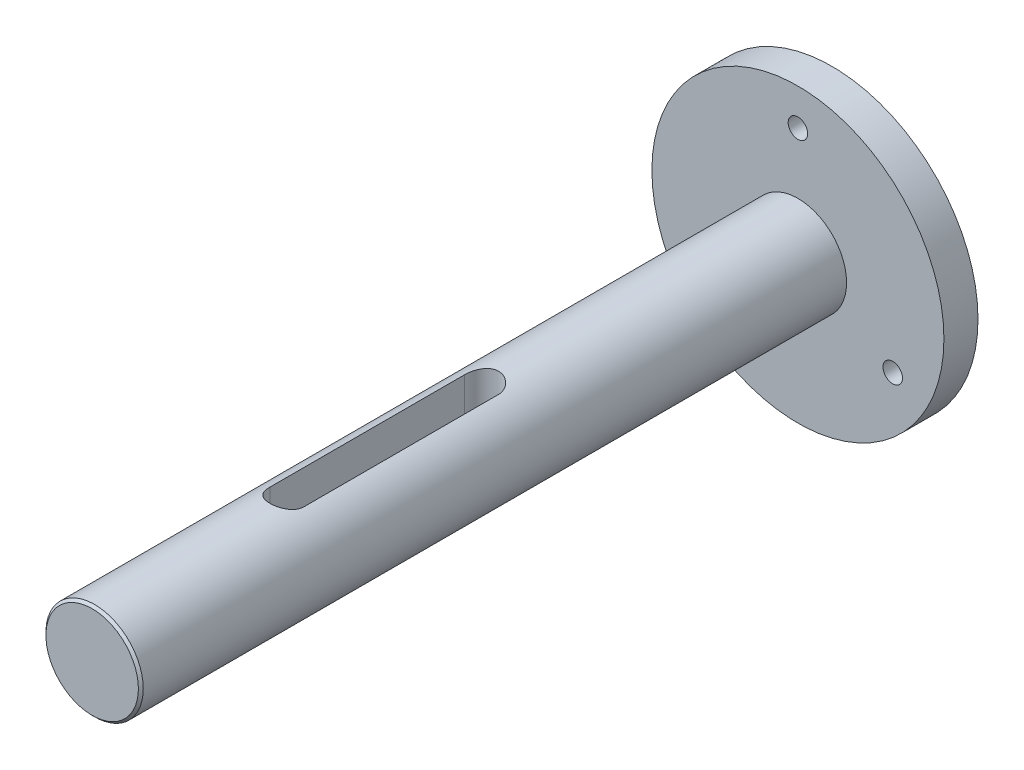
ISO-10303-21;
HEADER;
FILE_DESCRIPTION(('STEP AP214'),'2;1');
FILE_NAME('part.step','',(''),(''),'','','');
FILE_SCHEMA(('AUTOMOTIVE_DESIGN { 1 0 10303 214 1 1 1 1 }'));
ENDSEC;
DATA;
#1=APPLICATION_CONTEXT('core data for automotive mechanical design processes');
#2=APPLICATION_PROTOCOL_DEFINITION('international standard','automotive_design',2000,#1);
#3=PRODUCT_CONTEXT('',#1,'mechanical');
#4=PRODUCT('Part','Part','',(#3));
#5=PRODUCT_RELATED_PRODUCT_CATEGORY('part','',(#4));
#6=PRODUCT_DEFINITION_FORMATION('','',#4);
#7=PRODUCT_DEFINITION_CONTEXT('part definition',#1,'design');
#8=PRODUCT_DEFINITION('design','',#6,#7);
#9=PRODUCT_DEFINITION_SHAPE('','',#8);
#10=(LENGTH_UNIT() NAMED_UNIT(*) SI_UNIT(.MILLI.,.METRE.));
#11=(NAMED_UNIT(*) PLANE_ANGLE_UNIT() SI_UNIT($,.RADIAN.));
#12=(NAMED_UNIT(*) SI_UNIT($,.STERADIAN.) SOLID_ANGLE_UNIT());
#13=UNCERTAINTY_MEASURE_WITH_UNIT(LENGTH_MEASURE(1.E-05),#10,'distance_accuracy_value','');
#14=(GEOMETRIC_REPRESENTATION_CONTEXT(3) GLOBAL_UNCERTAINTY_ASSIGNED_CONTEXT((#13)) GLOBAL_UNIT_ASSIGNED_CONTEXT((#10,
#11,#12)) REPRESENTATION_CONTEXT('',''));
#15=CARTESIAN_POINT('',(0.,0.,0.));
#16=DIRECTION('',(0.,0.,1.));
#17=DIRECTION('',(1.,0.,0.));
#18=AXIS2_PLACEMENT_3D('',#15,#16,#17);
#19=CARTESIAN_POINT('',(0.,0.,7.));
#20=DIRECTION('',(0.,0.,1.));
#21=DIRECTION('',(1.,0.,0.));
#22=AXIS2_PLACEMENT_3D('',#19,#20,#21);
#23=PLANE('',#22);
#24=CARTESIAN_POINT('',(0.,0.,7.));
#25=DIRECTION('',(0.,0.,1.));
#26=DIRECTION('',(1.,0.,0.));
#27=AXIS2_PLACEMENT_3D('',#24,#25,#26);
#28=CIRCLE('',#27,10.);
#29=CARTESIAN_POINT('',(10.,0.,7.));
#30=VERTEX_POINT('',#29);
#31=EDGE_CURVE('E297',#30,#30,#28,.T.);
#32=ORIENTED_EDGE('',*,*,#31,.F.);
#33=EDGE_LOOP('',(#32));
#34=FACE_BOUND('',#33,.T.);
#35=CARTESIAN_POINT('',(19.4855715851499,-11.25,7.));
#36=DIRECTION('',(0.,0.,1.));
#37=DIRECTION('',(1.,0.,0.));
#38=AXIS2_PLACEMENT_3D('',#35,#36,#37);
#39=CIRCLE('',#38,2.);
#40=CARTESIAN_POINT('',(21.4855715851499,-11.25,7.));
#41=VERTEX_POINT('',#40);
#42=EDGE_CURVE('E307',#41,#41,#39,.T.);
#43=ORIENTED_EDGE('',*,*,#42,.F.);
#44=EDGE_LOOP('',(#43));
#45=FACE_BOUND('',#44,.T.);
#46=CARTESIAN_POINT('',(0.,0.,7.));
#47=DIRECTION('',(0.,0.,1.));
#48=DIRECTION('',(1.,0.,0.));
#49=AXIS2_PLACEMENT_3D('',#46,#47,#48);
#50=CIRCLE('',#49,30.);
#51=CARTESIAN_POINT('',(30.,0.,7.));
#52=VERTEX_POINT('',#51);
#53=EDGE_CURVE('E319',#52,#52,#50,.T.);
#54=ORIENTED_EDGE('',*,*,#53,.T.);
#55=EDGE_LOOP('',(#54));
#56=FACE_BOUND('',#55,.T.);
#57=CARTESIAN_POINT('',(0.,22.5,7.));
#58=DIRECTION('',(0.,0.,1.));
#59=DIRECTION('',(1.,0.,0.));
#60=AXIS2_PLACEMENT_3D('',#57,#58,#59);
#61=CIRCLE('',#60,2.);
#62=CARTESIAN_POINT('',(2.,22.5,7.));
#63=VERTEX_POINT('',#62);
#64=EDGE_CURVE('E313',#63,#63,#61,.T.);
#65=ORIENTED_EDGE('',*,*,#64,.F.);
#66=EDGE_LOOP('',(#65));
#67=FACE_BOUND('',#66,.T.);
#68=CARTESIAN_POINT('',(-19.4855715851499,-11.25,7.));
#69=DIRECTION('',(0.,0.,1.));
#70=DIRECTION('',(1.,0.,0.));
#71=AXIS2_PLACEMENT_3D('',#68,#69,#70);
#72=CIRCLE('',#71,2.);
#73=CARTESIAN_POINT('',(-17.4855715851499,-11.25,7.));
#74=VERTEX_POINT('',#73);
#75=EDGE_CURVE('E301',#74,#74,#72,.T.);
#76=ORIENTED_EDGE('',*,*,#75,.F.);
#77=EDGE_LOOP('',(#76));
#78=FACE_BOUND('',#77,.T.);
#79=ADVANCED_FACE('F33',(#34,#45,#56,#67,#78),#23,.T.);
#80=CARTESIAN_POINT('',(0.,0.,0.));
#81=DIRECTION('',(0.,0.,1.));
#82=DIRECTION('',(1.,0.,0.));
#83=AXIS2_PLACEMENT_3D('',#80,#81,#82);
#84=PLANE('',#83);
#85=CARTESIAN_POINT('',(0.,0.,0.));
#86=DIRECTION('',(0.,0.,1.));
#87=DIRECTION('',(1.,0.,0.));
#88=AXIS2_PLACEMENT_3D('',#85,#86,#87);
#89=CIRCLE('',#88,30.);
#90=CARTESIAN_POINT('',(30.,0.,0.));
#91=VERTEX_POINT('',#90);
#92=EDGE_CURVE('E316',#91,#91,#89,.T.);
#93=ORIENTED_EDGE('',*,*,#92,.F.);
#94=EDGE_LOOP('',(#93));
#95=FACE_BOUND('',#94,.T.);
#96=CARTESIAN_POINT('',(0.,22.5,0.));
#97=DIRECTION('',(0.,0.,1.));
#98=DIRECTION('',(1.,0.,0.));
#99=AXIS2_PLACEMENT_3D('',#96,#97,#98);
#100=CIRCLE('',#99,2.);
#101=CARTESIAN_POINT('',(2.,22.5,0.));
#102=VERTEX_POINT('',#101);
#103=EDGE_CURVE('E310',#102,#102,#100,.T.);
#104=ORIENTED_EDGE('',*,*,#103,.T.);
#105=EDGE_LOOP('',(#104));
#106=FACE_BOUND('',#105,.T.);
#107=CARTESIAN_POINT('',(19.4855715851499,-11.25,0.));
#108=DIRECTION('',(0.,0.,1.));
#109=DIRECTION('',(1.,0.,0.));
#110=AXIS2_PLACEMENT_3D('',#107,#108,#109);
#111=CIRCLE('',#110,2.);
#112=CARTESIAN_POINT('',(21.4855715851499,-11.25,0.));
#113=VERTEX_POINT('',#112);
#114=EDGE_CURVE('E304',#113,#113,#111,.T.);
#115=ORIENTED_EDGE('',*,*,#114,.T.);
#116=EDGE_LOOP('',(#115));
#117=FACE_BOUND('',#116,.T.);
#118=CARTESIAN_POINT('',(-19.4855715851499,-11.25,0.));
#119=DIRECTION('',(0.,0.,1.));
#120=DIRECTION('',(1.,0.,0.));
#121=AXIS2_PLACEMENT_3D('',#118,#119,#120);
#122=CIRCLE('',#121,2.);
#123=CARTESIAN_POINT('',(-17.4855715851499,-11.25,0.));
#124=VERTEX_POINT('',#123);
#125=EDGE_CURVE('E300',#124,#124,#122,.T.);
#126=ORIENTED_EDGE('',*,*,#125,.T.);
#127=EDGE_LOOP('',(#126));
#128=FACE_BOUND('',#127,.T.);
#129=ADVANCED_FACE('F194',(#95,#106,#117,#128),#84,.F.);
#130=CARTESIAN_POINT('',(0.,0.,7.));
#131=DIRECTION('',(0.,0.,-1.));
#132=DIRECTION('',(-1.,0.,0.));
#133=AXIS2_PLACEMENT_3D('',#130,#131,#132);
#134=CYLINDRICAL_SURFACE('',#133,30.);
#135=ORIENTED_EDGE('',*,*,#53,.F.);
#136=EDGE_LOOP('',(#135));
#137=FACE_BOUND('',#136,.T.);
#138=ORIENTED_EDGE('',*,*,#92,.T.);
#139=EDGE_LOOP('',(#138));
#140=FACE_BOUND('',#139,.T.);
#141=ADVANCED_FACE('F200',(#137,#140),#134,.T.);
#142=CARTESIAN_POINT('',(0.,22.5,7.));
#143=DIRECTION('',(0.,0.,-1.));
#144=DIRECTION('',(-1.,0.,0.));
#145=AXIS2_PLACEMENT_3D('',#142,#143,#144);
#146=CYLINDRICAL_SURFACE('',#145,2.);
#147=ORIENTED_EDGE('',*,*,#64,.T.);
#148=EDGE_LOOP('',(#147));
#149=FACE_BOUND('',#148,.T.);
#150=ORIENTED_EDGE('',*,*,#103,.F.);
#151=EDGE_LOOP('',(#150));
#152=FACE_BOUND('',#151,.T.);
#153=ADVANCED_FACE('F206',(#149,#152),#146,.F.);
#154=CARTESIAN_POINT('',(19.4855715851499,-11.25,7.));
#155=DIRECTION('',(0.,0.,-1.));
#156=DIRECTION('',(-1.,0.,0.));
#157=AXIS2_PLACEMENT_3D('',#154,#155,#156);
#158=CYLINDRICAL_SURFACE('',#157,2.);
#159=ORIENTED_EDGE('',*,*,#42,.T.);
#160=EDGE_LOOP('',(#159));
#161=FACE_BOUND('',#160,.T.);
#162=ORIENTED_EDGE('',*,*,#114,.F.);
#163=EDGE_LOOP('',(#162));
#164=FACE_BOUND('',#163,.T.);
#165=ADVANCED_FACE('F332',(#161,#164),#158,.F.);
#166=CARTESIAN_POINT('',(-19.4855715851499,-11.25,7.));
#167=DIRECTION('',(0.,0.,-1.));
#168=DIRECTION('',(-1.,0.,0.));
#169=AXIS2_PLACEMENT_3D('',#166,#167,#168);
#170=CYLINDRICAL_SURFACE('',#169,2.);
#171=ORIENTED_EDGE('',*,*,#75,.T.);
#172=EDGE_LOOP('',(#171));
#173=FACE_BOUND('',#172,.T.);
#174=ORIENTED_EDGE('',*,*,#125,.F.);
#175=EDGE_LOOP('',(#174));
#176=FACE_BOUND('',#175,.T.);
#177=ADVANCED_FACE('F190',(#173,#176),#170,.F.);
#178=CARTESIAN_POINT('',(0.,0.,152.));
#179=DIRECTION('',(0.,0.,-1.));
#180=DIRECTION('',(-1.,0.,0.));
#181=AXIS2_PLACEMENT_3D('',#178,#179,#180);
#182=CYLINDRICAL_SURFACE('',#181,10.);
#183=CARTESIAN_POINT('',(0.,0.,151.5));
#184=DIRECTION('',(0.,0.,1.));
#185=DIRECTION('',(1.,0.,0.));
#186=AXIS2_PLACEMENT_3D('',#183,#184,#185);
#187=CIRCLE('',#186,10.);
#188=CARTESIAN_POINT('',(10.,0.,151.5));
#189=VERTEX_POINT('',#188);
#190=EDGE_CURVE('E11',#189,#189,#187,.F.);
#191=ORIENTED_EDGE('',*,*,#190,.T.);
#192=EDGE_LOOP('',(#191));
#193=FACE_BOUND('',#192,.T.);
#194=DIRECTION('',(0.,0.,-1.));
#195=VECTOR('',#194,1.);
#196=CARTESIAN_POINT('',(2.00000000000001,-9.79795897113271,152.));
#197=LINE('',#196,#195);
#198=CARTESIAN_POINT('',(2.,-9.79795897113271,112.));
#199=VERTEX_POINT('',#198);
#200=CARTESIAN_POINT('',(2.,-9.79795897113271,72.));
#201=VERTEX_POINT('',#200);
#202=EDGE_CURVE('E120',#199,#201,#197,.T.);
#203=ORIENTED_EDGE('',*,*,#202,.T.);
#204=CARTESIAN_POINT('',(2.,-9.79795897113271,72.));
#205=CARTESIAN_POINT('',(2.00000029709046,-9.79795611157838,71.9443328627013));
#206=CARTESIAN_POINT('',(1.99767440405642,-9.79843398465431,71.8886929611951));
#207=CARTESIAN_POINT('',(1.98839986829158,-9.80032138150132,71.7778225643325));
#208=CARTESIAN_POINT('',(1.98145179742019,-9.80173079002197,71.7225920191848));
#209=CARTESIAN_POINT('',(1.95376239954903,-9.8073028328515,71.5582901196985));
#210=CARTESIAN_POINT('',(1.92617555297558,-9.81280956758554,71.4503371424655));
#211=CARTESIAN_POINT('',(1.85359362042638,-9.8267766040168,71.2407148065161));
#212=CARTESIAN_POINT('',(1.80859661275257,-9.83523723174864,71.1390461428865));
#213=CARTESIAN_POINT('',(1.7025082088197,-9.85415440257657,70.9446702322403));
#214=CARTESIAN_POINT('',(1.64141514447462,-9.86461115250626,70.8519639153823));
#215=CARTESIAN_POINT('',(1.50396101869286,-9.88650550448304,70.6768803266299));
#216=CARTESIAN_POINT('',(1.42741780364327,-9.89795377776164,70.5946474355412));
#217=CARTESIAN_POINT('',(1.2616211819837,-9.92044851228358,70.4440911214249));
#218=CARTESIAN_POINT('',(1.17236580968336,-9.93149491105252,70.3757698535391));
#219=CARTESIAN_POINT('',(0.98272010680059,-9.95205620855081,70.2544221981526));
#220=CARTESIAN_POINT('',(0.882239649549984,-9.96155694564014,70.2015340615754));
#221=CARTESIAN_POINT('',(0.673602404217795,-9.97783510908995,70.1134482309004));
#222=CARTESIAN_POINT('',(0.565446754297826,-9.9846129382442,70.0782479200882));
#223=CARTESIAN_POINT('',(0.346034817774201,-9.99460635553984,70.0269859030622));
#224=CARTESIAN_POINT('',(0.234838069151993,-9.99786765043076,70.0106784210322));
#225=CARTESIAN_POINT('',(0.0112397534982616,-10.0006184349224,69.9968980411232));
#226=CARTESIAN_POINT('',(-0.101161724783848,-10.000108200481,69.9994237652431));
#227=CARTESIAN_POINT('',(-0.322284405513384,-9.99540868887644,70.0230524007432));
#228=CARTESIAN_POINT('',(-0.431035226714458,-9.9912719366342,70.0438900998095));
#229=CARTESIAN_POINT('',(-0.643464013108166,-9.97984349003516,70.1031303539521));
#230=CARTESIAN_POINT('',(-0.747141812282546,-9.97255169250401,70.1415334834445));
#231=CARTESIAN_POINT('',(-0.94724054262592,-9.95554578241051,70.2350608069907));
#232=CARTESIAN_POINT('',(-1.04361145363295,-9.94581664782192,70.2902891738519));
#233=CARTESIAN_POINT('',(-1.22581287576612,-9.92500903258345,70.4158205405534));
#234=CARTESIAN_POINT('',(-1.31164251244036,-9.91393044014086,70.4861247896875));
#235=CARTESIAN_POINT('',(-1.47189241307715,-9.8914207473701,70.6412567232505));
#236=CARTESIAN_POINT('',(-1.54608938999208,-9.8799868648348,70.7263148041431));
#237=CARTESIAN_POINT('',(-1.67922179979889,-9.85823412232848,70.9078095169778));
#238=CARTESIAN_POINT('',(-1.73815300484306,-9.84791557170815,71.0042492903325));
#239=CARTESIAN_POINT('',(-1.83915990928954,-9.82955460084642,71.2061048098918));
#240=CARTESIAN_POINT('',(-1.881189753269,-9.82151838996691,71.3115440467932));
#241=CARTESIAN_POINT('',(-1.94681419465982,-9.80872322124987,71.5281172625114));
#242=CARTESIAN_POINT('',(-1.97043625496865,-9.80395938256574,71.6392424932963));
#243=CARTESIAN_POINT('',(-1.98966587624393,-9.80006354383926,71.7927136336929));
#244=CARTESIAN_POINT('',(-1.99354251131102,-9.79927519743986,71.8341082795649));
#245=CARTESIAN_POINT('',(-1.9987063293293,-9.79822334773544,71.9169957282748));
#246=CARTESIAN_POINT('',(-1.99999784580931,-9.79795896609649,71.9584882499116));
#247=CARTESIAN_POINT('',(-2.,-9.79795897113271,72.));
#248=B_SPLINE_CURVE_WITH_KNOTS('',3,(#204,#205,#206,#207,#208,#209,#210,#211,#212,#213,#214,
#215,#216,#217,#218,#219,#220,#221,#222,#223,#224,#225,#226,#227,#228,#229,#230,#231,#232,#233,
#234,#235,#236,#237,#238,#239,#240,#241,#242,#243,#244,#245,#246,#247),.UNSPECIFIED.,.F.,.F.,(4,
2,2,2,2,2,2,2,2,2,2,2,2,2,2,2,2,2,2,2,2,4),(0.,0.166897020715831,0.333773396643063,
0.666722601037227,0.999708566174145,1.33272905329863,1.66993288931438,2.00718892413591,
2.34737937755194,2.68751948879678,3.02318320738907,3.35882236614863,3.68967912555437,
4.02054670525121,4.35350597112352,4.68649283901807,5.02524540329292,5.3640916848566,
5.70385119298727,6.04310283225103,6.16778801087549,6.29226399953896),.UNSPECIFIED.);
#249=CARTESIAN_POINT('',(-2.,-9.79795897113272,72.));
#250=VERTEX_POINT('',#249);
#251=EDGE_CURVE('E112',#201,#250,#248,.T.);
#252=ORIENTED_EDGE('',*,*,#251,.T.);
#253=DIRECTION('',(0.,0.,-1.));
#254=VECTOR('',#253,1.);
#255=CARTESIAN_POINT('',(-1.99999999999999,-9.79795897113272,152.));
#256=LINE('',#255,#254);
#257=CARTESIAN_POINT('',(-1.99999999999999,-9.79795897113272,112.));
#258=VERTEX_POINT('',#257);
#259=EDGE_CURVE('E98',#250,#258,#256,.F.);
#260=ORIENTED_EDGE('',*,*,#259,.T.);
#261=CARTESIAN_POINT('',(-2.,-9.79795897113271,112.));
#262=CARTESIAN_POINT('',(-2.00000029709046,-9.79795611157838,112.055667137299));
#263=CARTESIAN_POINT('',(-1.99767440405641,-9.79843398465431,112.111307038805));
#264=CARTESIAN_POINT('',(-1.98839986829158,-9.80032138150132,112.222177435668));
#265=CARTESIAN_POINT('',(-1.98145179742018,-9.80173079002197,112.277407980815));
#266=CARTESIAN_POINT('',(-1.95376239954903,-9.8073028328515,112.441709880302));
#267=CARTESIAN_POINT('',(-1.92617555297558,-9.81280956758554,112.549662857534));
#268=CARTESIAN_POINT('',(-1.85359362042638,-9.8267766040168,112.759285193484));
#269=CARTESIAN_POINT('',(-1.80859661275256,-9.83523723174864,112.860953857114));
#270=CARTESIAN_POINT('',(-1.70250820881969,-9.85415440257657,113.05532976776));
#271=CARTESIAN_POINT('',(-1.64141514447461,-9.86461115250626,113.148036084618));
#272=CARTESIAN_POINT('',(-1.50396101869286,-9.88650550448304,113.32311967337));
#273=CARTESIAN_POINT('',(-1.42741780364327,-9.89795377776164,113.405352564459));
#274=CARTESIAN_POINT('',(-1.26162118198369,-9.92044851228359,113.555908878575));
#275=CARTESIAN_POINT('',(-1.17236580968335,-9.93149491105252,113.624230146461));
#276=CARTESIAN_POINT('',(-0.982720106800578,-9.95205620855081,113.745577801847));
#277=CARTESIAN_POINT('',(-0.882239649549973,-9.96155694564014,113.798465938425));
#278=CARTESIAN_POINT('',(-0.673602404217787,-9.97783510908995,113.8865517691));
#279=CARTESIAN_POINT('',(-0.565446754297818,-9.9846129382442,113.921752079912));
#280=CARTESIAN_POINT('',(-0.346034817774195,-9.99460635553984,113.973014096938));
#281=CARTESIAN_POINT('',(-0.234838069151987,-9.99786765043076,113.989321578968));
#282=CARTESIAN_POINT('',(-0.0112397534982561,-10.0006184349224,114.003101958877));
#283=CARTESIAN_POINT('',(0.101161724783853,-10.000108200481,114.000576234757));
#284=CARTESIAN_POINT('',(0.322284405513389,-9.99540868887644,113.976947599257));
#285=CARTESIAN_POINT('',(0.431035226714463,-9.9912719366342,113.95610990019));
#286=CARTESIAN_POINT('',(0.643464013108171,-9.97984349003515,113.896869646048));
#287=CARTESIAN_POINT('',(0.747141812282551,-9.97255169250401,113.858466516556));
#288=CARTESIAN_POINT('',(0.947240542625925,-9.95554578241051,113.764939193009));
#289=CARTESIAN_POINT('',(1.04361145363295,-9.94581664782192,113.709710826148));
#290=CARTESIAN_POINT('',(1.22581287576613,-9.92500903258345,113.584179459447));
#291=CARTESIAN_POINT('',(1.31164251244037,-9.91393044014085,113.513875210313));
#292=CARTESIAN_POINT('',(1.47189241307715,-9.8914207473701,113.35874327675));
#293=CARTESIAN_POINT('',(1.54608938999208,-9.8799868648348,113.273685195857));
#294=CARTESIAN_POINT('',(1.6792217997989,-9.85823412232848,113.092190483022));
#295=CARTESIAN_POINT('',(1.73815300484307,-9.84791557170815,112.995750709668));
#296=CARTESIAN_POINT('',(1.83915990928954,-9.82955460084642,112.793895190108));
#297=CARTESIAN_POINT('',(1.88118975326901,-9.8215183899669,112.688455953207));
#298=CARTESIAN_POINT('',(1.94681419465983,-9.80872322124987,112.471882737489));
#299=CARTESIAN_POINT('',(1.97043625496866,-9.80395938256574,112.360757506704));
#300=CARTESIAN_POINT('',(1.98966587624394,-9.80006354383926,112.207286366307));
#301=CARTESIAN_POINT('',(1.99354251131102,-9.79927519743986,112.165891720435));
#302=CARTESIAN_POINT('',(1.99870632932931,-9.79822334773544,112.083004271725));
#303=CARTESIAN_POINT('',(1.99999784580931,-9.79795896609649,112.041511750088));
#304=CARTESIAN_POINT('',(2.,-9.79795897113271,112.));
#305=B_SPLINE_CURVE_WITH_KNOTS('',3,(#261,#262,#263,#264,#265,#266,#267,#268,#269,#270,#271,
#272,#273,#274,#275,#276,#277,#278,#279,#280,#281,#282,#283,#284,#285,#286,#287,#288,#289,#290,
#291,#292,#293,#294,#295,#296,#297,#298,#299,#300,#301,#302,#303,#304),.UNSPECIFIED.,.F.,.F.,(4,
2,2,2,2,2,2,2,2,2,2,2,2,2,2,2,2,2,2,2,2,4),(0.,0.166897020715831,0.333773396643063,
0.666722601037227,0.999708566174161,1.33272905329863,1.66993288931438,2.00718892413592,
2.34737937755194,2.68751948879679,3.02318320738907,3.35882236614863,3.68967912555437,
4.02054670525121,4.35350597112352,4.68649283901807,5.02524540329292,5.3640916848566,
5.70385119298727,6.04310283225103,6.16778801087549,6.29226399953897),.UNSPECIFIED.);
#306=EDGE_CURVE('E106',#258,#199,#305,.T.);
#307=ORIENTED_EDGE('',*,*,#306,.T.);
#308=EDGE_LOOP('',(#203,#252,#260,#307));
#309=FACE_BOUND('',#308,.T.);
#310=DIRECTION('',(0.,0.,-1.));
#311=VECTOR('',#310,1.);
#312=CARTESIAN_POINT('',(-3.49999999999998,9.36749699759761,152.));
#313=LINE('',#312,#311);
#314=CARTESIAN_POINT('',(-3.49999999999999,9.36749699759761,112.));
#315=VERTEX_POINT('',#314);
#316=CARTESIAN_POINT('',(-3.49999999999998,9.36749699759761,72.));
#317=VERTEX_POINT('',#316);
#318=EDGE_CURVE('E169',#315,#317,#313,.T.);
#319=ORIENTED_EDGE('',*,*,#318,.T.);
#320=CARTESIAN_POINT('',(-3.49999999999999,9.3674969975976,72.));
#321=CARTESIAN_POINT('',(-3.50001290870869,9.36748079587137,71.9048181116927));
#322=CARTESIAN_POINT('',(-3.49611761580102,9.36894731061929,71.8096451979097));
#323=CARTESIAN_POINT('',(-3.48061126373695,9.37472506597358,71.620044223493));
#324=CARTESIAN_POINT('',(-3.46900248030438,9.37903546754067,71.5256159514784));
#325=CARTESIAN_POINT('',(-3.43821870694647,9.39036238019064,71.3384722809881));
#326=CARTESIAN_POINT('',(-3.41906789874553,9.39737024089891,71.2457523899186));
#327=CARTESIAN_POINT('',(-3.37340050494782,9.41385972932497,71.0623927150488));
#328=CARTESIAN_POINT('',(-3.34688361210789,9.42334146022815,70.9717530181853));
#329=CARTESIAN_POINT('',(-3.25665102509456,9.45506925925654,70.7040057734071));
#330=CARTESIAN_POINT('',(-3.18220361335761,9.48061744208823,70.5307711595539));
#331=CARTESIAN_POINT('',(-3.0070608913158,9.53761078303878,70.1992127837941));
#332=CARTESIAN_POINT('',(-2.90634738094283,9.56906002581126,70.0408994649774));
#333=CARTESIAN_POINT('',(-2.67688504812342,9.63582305978961,69.7368302162237));
#334=CARTESIAN_POINT('',(-2.54719588179148,9.67123974471417,69.5918050065814));
#335=CARTESIAN_POINT('',(-2.26546924856877,9.74108248534927,69.3250606895947));
#336=CARTESIAN_POINT('',(-2.11342768558354,9.77550835810713,69.2033458633302));
#337=CARTESIAN_POINT('',(-1.78584763006842,9.8407010706004,68.9832487000321));
#338=CARTESIAN_POINT('',(-1.60975388514351,9.87133218670086,68.8856489105183));
#339=CARTESIAN_POINT('',(-1.24239517910167,9.92425433590848,68.7217580525229));
#340=CARTESIAN_POINT('',(-1.05113527005908,9.94654813227259,68.6554566088448));
#341=CARTESIAN_POINT('',(-0.666590670274821,9.9795521899784,68.5585669112024));
#342=CARTESIAN_POINT('',(-0.47365987953881,9.99067089828651,68.5267158533532));
#343=CARTESIAN_POINT('',(-0.0848892814690368,10.0015281517553,68.4956038123617));
#344=CARTESIAN_POINT('',(0.110949741576456,10.0012697113129,68.4963341967058));
#345=CARTESIAN_POINT('',(0.490989738317242,9.98967161458308,68.5295896861643));
#346=CARTESIAN_POINT('',(0.675328059399544,9.97881100976233,68.5607402961428));
#347=CARTESIAN_POINT('',(1.03597082893503,9.94784089465941,68.651663950139));
#348=CARTESIAN_POINT('',(1.21227482460013,9.92773086381682,68.7114386051342));
#349=CARTESIAN_POINT('',(1.55471480559253,9.87993873138756,68.8586488544662));
#350=CARTESIAN_POINT('',(1.72067709782706,9.85215605871141,68.9464544388301));
#351=CARTESIAN_POINT('',(2.03590245131128,9.79187891683701,69.1469297704341));
#352=CARTESIAN_POINT('',(2.18516057457972,9.75938306084104,69.2596068409212));
#353=CARTESIAN_POINT('',(2.47086486770539,9.69110493662308,69.5133939345507));
#354=CARTESIAN_POINT('',(2.60625579568017,9.6552396043588,69.655669142123));
#355=CARTESIAN_POINT('',(2.85168490599478,9.58562532903772,69.9613086968956));
#356=CARTESIAN_POINT('',(2.96171430533782,9.55187712210248,70.1246803195652));
#357=CARTESIAN_POINT('',(3.10613834866616,9.50549949812691,70.3838437664487));
#358=CARTESIAN_POINT('',(3.15115700621636,9.49063185556225,70.4734697342177));
#359=CARTESIAN_POINT('',(3.23342988727473,9.46291794916449,70.6565040964853));
#360=CARTESIAN_POINT('',(3.27068737190209,9.45007083689549,70.7499108825613));
#361=CARTESIAN_POINT('',(3.33706008311089,9.42683763789705,70.9397485417923));
#362=CARTESIAN_POINT('',(3.36618438368869,9.41644881051096,71.0361759102372));
#363=CARTESIAN_POINT('',(3.41604788941062,9.39847413377985,71.231390715419));
#364=CARTESIAN_POINT('',(3.43679090503094,9.39088701080038,71.3301770579848));
#365=CARTESIAN_POINT('',(3.46877858288808,9.37911856107459,71.5238991681075));
#366=CARTESIAN_POINT('',(3.48048118596837,9.37477347975878,71.6187495549571));
#367=CARTESIAN_POINT('',(3.49609410027634,9.36895606934958,71.8090640867413));
#368=CARTESIAN_POINT('',(3.50001350432683,9.36748038808456,71.904527384614));
#369=CARTESIAN_POINT('',(3.50000000000001,9.36749699759759,72.));
#370=B_SPLINE_CURVE_WITH_KNOTS('',3,(#320,#321,#322,#323,#324,#325,#326,#327,#328,#329,#330,
#331,#332,#333,#334,#335,#336,#337,#338,#339,#340,#341,#342,#343,#344,#345,#346,#347,#348,#349,
#350,#351,#352,#353,#354,#355,#356,#357,#358,#359,#360,#361,#362,#363,#364,#365,#366,#367,#368,
#369),.UNSPECIFIED.,.F.,.F.,(4,2,2,2,2,2,2,2,2,2,2,2,2,2,2,2,2,2,2,2,2,2,2,2,4),(0.,
0.28543958649855,0.570794996655615,0.855242834861577,1.13970253931451,1.70772241452019,
2.27613692750188,2.86672388712457,3.45741920749039,4.0653135246422,4.67300618705685,
5.25757795850424,5.84199484749217,6.40117226237549,6.96038115177995,7.52729965431416,
8.09438530550649,8.69066694236568,9.28715476937553,9.59101301765141,9.89474333092357,
10.1981334133619,10.5013854065907,10.788030808142,11.0743411350263),.UNSPECIFIED.);
#371=CARTESIAN_POINT('',(3.50000000000001,9.36749699759759,72.));
#372=VERTEX_POINT('',#371);
#373=EDGE_CURVE('E173',#317,#372,#370,.T.);
#374=ORIENTED_EDGE('',*,*,#373,.T.);
#375=DIRECTION('',(0.,0.,-1.));
#376=VECTOR('',#375,1.);
#377=CARTESIAN_POINT('',(3.50000000000002,9.36749699759759,152.));
#378=LINE('',#377,#376);
#379=CARTESIAN_POINT('',(3.50000000000001,9.36749699759759,112.));
#380=VERTEX_POINT('',#379);
#381=EDGE_CURVE('E168',#372,#380,#378,.F.);
#382=ORIENTED_EDGE('',*,*,#381,.T.);
#383=CARTESIAN_POINT('',(3.50000000000001,9.36749699759759,112.));
#384=CARTESIAN_POINT('',(3.50001290870871,9.36748079587136,112.095181888307));
#385=CARTESIAN_POINT('',(3.49611761580104,9.36894731061929,112.19035480209));
#386=CARTESIAN_POINT('',(3.48061126373697,9.37472506597357,112.379955776507));
#387=CARTESIAN_POINT('',(3.4690024803044,9.37903546754067,112.474384048522));
#388=CARTESIAN_POINT('',(3.43821870694649,9.39036238019064,112.661527719012));
#389=CARTESIAN_POINT('',(3.41906789874555,9.3973702408989,112.754247610081));
#390=CARTESIAN_POINT('',(3.37340050494784,9.41385972932496,112.937607284951));
#391=CARTESIAN_POINT('',(3.34688361210791,9.42334146022814,113.028246981815));
#392=CARTESIAN_POINT('',(3.25665102509458,9.45506925925653,113.295994226593));
#393=CARTESIAN_POINT('',(3.18220361335763,9.48061744208822,113.469228840446));
#394=CARTESIAN_POINT('',(3.00706089131582,9.53761078303877,113.800787216206));
#395=CARTESIAN_POINT('',(2.90634738094285,9.56906002581126,113.959100535023));
#396=CARTESIAN_POINT('',(2.67688504812345,9.63582305978961,114.263169783776));
#397=CARTESIAN_POINT('',(2.5471958817915,9.67123974471416,114.408194993419));
#398=CARTESIAN_POINT('',(2.2654692485688,9.74108248534926,114.674939310405));
#399=CARTESIAN_POINT('',(2.11342768558357,9.77550835810712,114.79665413667));
#400=CARTESIAN_POINT('',(1.78584763006845,9.8407010706004,115.016751299968));
#401=CARTESIAN_POINT('',(1.60975388514353,9.87133218670085,115.114351089482));
#402=CARTESIAN_POINT('',(1.2423951791017,9.92425433590847,115.278241947477));
#403=CARTESIAN_POINT('',(1.05113527005911,9.94654813227259,115.344543391155));
#404=CARTESIAN_POINT('',(0.666590670274856,9.97955218997839,115.441433088798));
#405=CARTESIAN_POINT('',(0.473659879538841,9.99067089828651,115.473284146647));
#406=CARTESIAN_POINT('',(0.0848892814690629,10.0015281517553,115.504396187638));
#407=CARTESIAN_POINT('',(-0.110949741576432,10.0012697113129,115.503665803294));
#408=CARTESIAN_POINT('',(-0.49098973831722,9.98967161458308,115.470410313836));
#409=CARTESIAN_POINT('',(-0.675328059399521,9.97881100976233,115.439259703857));
#410=CARTESIAN_POINT('',(-1.03597082893501,9.94784089465942,115.348336049861));
#411=CARTESIAN_POINT('',(-1.21227482460011,9.92773086381682,115.288561394866));
#412=CARTESIAN_POINT('',(-1.55471480559251,9.87993873138757,115.141351145534));
#413=CARTESIAN_POINT('',(-1.72067709782703,9.85215605871141,115.05354556117));
#414=CARTESIAN_POINT('',(-2.03590245131126,9.79187891683701,114.853070229566));
#415=CARTESIAN_POINT('',(-2.18516057457969,9.75938306084105,114.740393159079));
#416=CARTESIAN_POINT('',(-2.47086486770537,9.69110493662308,114.486606065449));
#417=CARTESIAN_POINT('',(-2.60625579568015,9.65523960435881,114.344330857877));
#418=CARTESIAN_POINT('',(-2.85168490599476,9.58562532903773,114.038691303104));
#419=CARTESIAN_POINT('',(-2.9617143053378,9.55187712210249,113.875319680435));
#420=CARTESIAN_POINT('',(-3.10613834866614,9.50549949812691,113.616156233551));
#421=CARTESIAN_POINT('',(-3.15115700621633,9.49063185556226,113.526530265782));
#422=CARTESIAN_POINT('',(-3.23342988727471,9.4629179491645,113.343495903515));
#423=CARTESIAN_POINT('',(-3.27068737190206,9.4500708368955,113.250089117439));
#424=CARTESIAN_POINT('',(-3.33706008311087,9.42683763789706,113.060251458208));
#425=CARTESIAN_POINT('',(-3.36618438368866,9.41644881051097,112.963824089763));
#426=CARTESIAN_POINT('',(-3.4160478894106,9.39847413377986,112.768609284581));
#427=CARTESIAN_POINT('',(-3.43679090503091,9.39088701080038,112.669822942015));
#428=CARTESIAN_POINT('',(-3.46877858288805,9.3791185610746,112.476100831893));
#429=CARTESIAN_POINT('',(-3.48048118596835,9.37477347975879,112.381250445043));
#430=CARTESIAN_POINT('',(-3.49609410027631,9.3689560693496,112.190935913259));
#431=CARTESIAN_POINT('',(-3.5000135043268,9.36748038808457,112.095472615386));
#432=CARTESIAN_POINT('',(-3.49999999999999,9.3674969975976,112.));
#433=B_SPLINE_CURVE_WITH_KNOTS('',3,(#383,#384,#385,#386,#387,#388,#389,#390,#391,#392,#393,
#394,#395,#396,#397,#398,#399,#400,#401,#402,#403,#404,#405,#406,#407,#408,#409,#410,#411,#412,
#413,#414,#415,#416,#417,#418,#419,#420,#421,#422,#423,#424,#425,#426,#427,#428,#429,#430,#431,
#432),.UNSPECIFIED.,.F.,.F.,(4,2,2,2,2,2,2,2,2,2,2,2,2,2,2,2,2,2,2,2,2,2,2,2,4),(0.,
0.28543958649855,0.570794996655615,0.855242834861577,1.13970253931451,1.70772241452019,
2.27613692750188,2.86672388712457,3.45741920749039,4.0653135246422,4.67300618705684,
5.25757795850424,5.84199484749217,6.40117226237549,6.96038115177995,7.52729965431416,
8.09438530550649,8.69066694236568,9.28715476937553,9.59101301765141,9.89474333092357,
10.1981334133619,10.5013854065907,10.788030808142,11.0743411350263),.UNSPECIFIED.);
#434=EDGE_CURVE('E160',#380,#315,#433,.T.);
#435=ORIENTED_EDGE('',*,*,#434,.T.);
#436=EDGE_LOOP('',(#319,#374,#382,#435));
#437=FACE_BOUND('',#436,.T.);
#438=ORIENTED_EDGE('',*,*,#31,.T.);
#439=EDGE_LOOP('',(#438));
#440=FACE_BOUND('',#439,.T.);
#441=ADVANCED_FACE('F118',(#193,#309,#437,#440),#182,.T.);
#442=CARTESIAN_POINT('',(0.,0.,152.));
#443=DIRECTION('',(0.,0.,1.));
#444=DIRECTION('',(1.,0.,0.));
#445=AXIS2_PLACEMENT_3D('',#442,#443,#444);
#446=PLANE('',#445);
#447=CARTESIAN_POINT('',(0.,0.,152.));
#448=DIRECTION('',(0.,0.,1.));
#449=DIRECTION('',(1.,0.,0.));
#450=AXIS2_PLACEMENT_3D('',#447,#448,#449);
#451=CIRCLE('',#450,9.50000000000002);
#452=CARTESIAN_POINT('',(9.50000000000002,0.,152.));
#453=VERTEX_POINT('',#452);
#454=EDGE_CURVE('E41',#453,#453,#451,.T.);
#455=ORIENTED_EDGE('',*,*,#454,.T.);
#456=EDGE_LOOP('',(#455));
#457=FACE_BOUND('',#456,.T.);
#458=ADVANCED_FACE('F183',(#457),#446,.T.);
#459=CARTESIAN_POINT('',(0.,-1.5,72.));
#460=DIRECTION('',(0.,1.,0.));
#461=DIRECTION('',(0.,0.,1.));
#462=AXIS2_PLACEMENT_3D('',#459,#460,#461);
#463=CYLINDRICAL_SURFACE('',#462,3.5);
#464=DIRECTION('',(0.,1.,0.));
#465=VECTOR('',#464,1.);
#466=CARTESIAN_POINT('',(-3.49999999999999,-1.5,72.));
#467=LINE('',#466,#465);
#468=CARTESIAN_POINT('',(-3.49999999999999,0.,72.));
#469=VERTEX_POINT('',#468);
#470=EDGE_CURVE('E252',#469,#317,#467,.T.);
#471=ORIENTED_EDGE('',*,*,#470,.F.);
#472=CARTESIAN_POINT('',(0.,0.,72.));
#473=DIRECTION('',(0.,1.,0.));
#474=DIRECTION('',(0.,0.,1.));
#475=AXIS2_PLACEMENT_3D('',#472,#473,#474);
#476=CIRCLE('',#475,3.5);
#477=CARTESIAN_POINT('',(3.50000000000001,0.,72.));
#478=VERTEX_POINT('',#477);
#479=EDGE_CURVE('E233',#469,#478,#476,.F.);
#480=ORIENTED_EDGE('',*,*,#479,.T.);
#481=DIRECTION('',(0.,1.,0.));
#482=VECTOR('',#481,1.);
#483=CARTESIAN_POINT('',(3.50000000000001,-1.5,72.));
#484=LINE('',#483,#482);
#485=EDGE_CURVE('E135',#478,#372,#484,.T.);
#486=ORIENTED_EDGE('',*,*,#485,.T.);
#487=ORIENTED_EDGE('',*,*,#373,.F.);
#488=EDGE_LOOP('',(#471,#480,#486,#487));
#489=FACE_BOUND('',#488,.T.);
#490=ADVANCED_FACE('F151',(#489),#463,.F.);
#491=CARTESIAN_POINT('',(3.50000000000001,-1.5,72.));
#492=DIRECTION('',(1.,0.,0.));
#493=DIRECTION('',(0.,0.,-1.));
#494=AXIS2_PLACEMENT_3D('',#491,#492,#493);
#495=PLANE('',#494);
#496=ORIENTED_EDGE('',*,*,#485,.F.);
#497=DIRECTION('',(0.,0.,1.));
#498=VECTOR('',#497,1.);
#499=CARTESIAN_POINT('',(3.50000000000001,0.,72.));
#500=LINE('',#499,#498);
#501=CARTESIAN_POINT('',(3.50000000000001,0.,112.));
#502=VERTEX_POINT('',#501);
#503=EDGE_CURVE('E239',#478,#502,#500,.T.);
#504=ORIENTED_EDGE('',*,*,#503,.T.);
#505=DIRECTION('',(0.,1.,0.));
#506=VECTOR('',#505,1.);
#507=CARTESIAN_POINT('',(3.50000000000001,-1.5,112.));
#508=LINE('',#507,#506);
#509=EDGE_CURVE('E292',#502,#380,#508,.T.);
#510=ORIENTED_EDGE('',*,*,#509,.T.);
#511=ORIENTED_EDGE('',*,*,#381,.F.);
#512=EDGE_LOOP('',(#496,#504,#510,#511));
#513=FACE_BOUND('',#512,.T.);
#514=ADVANCED_FACE('F147',(#513),#495,.F.);
#515=CARTESIAN_POINT('',(0.,-1.5,112.));
#516=DIRECTION('',(0.,1.,0.));
#517=DIRECTION('',(0.,0.,1.));
#518=AXIS2_PLACEMENT_3D('',#515,#516,#517);
#519=CYLINDRICAL_SURFACE('',#518,3.5);
#520=ORIENTED_EDGE('',*,*,#509,.F.);
#521=CARTESIAN_POINT('',(0.,0.,112.));
#522=DIRECTION('',(0.,1.,0.));
#523=DIRECTION('',(0.,0.,1.));
#524=AXIS2_PLACEMENT_3D('',#521,#522,#523);
#525=CIRCLE('',#524,3.5);
#526=CARTESIAN_POINT('',(-3.49999999999999,0.,112.));
#527=VERTEX_POINT('',#526);
#528=EDGE_CURVE('E242',#502,#527,#525,.F.);
#529=ORIENTED_EDGE('',*,*,#528,.T.);
#530=DIRECTION('',(0.,1.,0.));
#531=VECTOR('',#530,1.);
#532=CARTESIAN_POINT('',(-3.49999999999999,-1.5,112.));
#533=LINE('',#532,#531);
#534=EDGE_CURVE('E290',#527,#315,#533,.T.);
#535=ORIENTED_EDGE('',*,*,#534,.T.);
#536=ORIENTED_EDGE('',*,*,#434,.F.);
#537=EDGE_LOOP('',(#520,#529,#535,#536));
#538=FACE_BOUND('',#537,.T.);
#539=ADVANCED_FACE('F150',(#538),#519,.F.);
#540=CARTESIAN_POINT('',(-3.49999999999999,-1.5,72.));
#541=DIRECTION('',(-1.,0.,0.));
#542=DIRECTION('',(0.,0.,1.));
#543=AXIS2_PLACEMENT_3D('',#540,#541,#542);
#544=PLANE('',#543);
#545=ORIENTED_EDGE('',*,*,#534,.F.);
#546=DIRECTION('',(0.,0.,-1.));
#547=VECTOR('',#546,1.);
#548=CARTESIAN_POINT('',(-3.49999999999999,0.,72.));
#549=LINE('',#548,#547);
#550=EDGE_CURVE('E56',#527,#469,#549,.T.);
#551=ORIENTED_EDGE('',*,*,#550,.T.);
#552=ORIENTED_EDGE('',*,*,#470,.T.);
#553=ORIENTED_EDGE('',*,*,#318,.F.);
#554=EDGE_LOOP('',(#545,#551,#552,#553));
#555=FACE_BOUND('',#554,.T.);
#556=ADVANCED_FACE('F156',(#555),#544,.F.);
#557=CARTESIAN_POINT('',(0.,-1.5,72.));
#558=DIRECTION('',(0.,1.,0.));
#559=DIRECTION('',(0.,0.,1.));
#560=AXIS2_PLACEMENT_3D('',#557,#558,#559);
#561=CONICAL_SURFACE('',#560,2.,0.785398163397449);
#562=DIRECTION('',(-0.707106781186548,-0.707106781186547,0.));
#563=VECTOR('',#562,1.);
#564=CARTESIAN_POINT('',(3.50000000000001,0.,72.));
#565=LINE('',#564,#563);
#566=CARTESIAN_POINT('',(2.,-1.50000000000001,72.));
#567=VERTEX_POINT('',#566);
#568=EDGE_CURVE('E231',#478,#567,#565,.T.);
#569=ORIENTED_EDGE('',*,*,#568,.F.);
#570=ORIENTED_EDGE('',*,*,#479,.F.);
#571=DIRECTION('',(-0.707106781186548,0.707106781186547,0.));
#572=VECTOR('',#571,1.);
#573=CARTESIAN_POINT('',(-1.99999999999999,-1.5,72.));
#574=LINE('',#573,#572);
#575=CARTESIAN_POINT('',(-2.,-1.49999999999999,72.));
#576=VERTEX_POINT('',#575);
#577=EDGE_CURVE('E236',#576,#469,#574,.T.);
#578=ORIENTED_EDGE('',*,*,#577,.F.);
#579=CARTESIAN_POINT('',(0.,-1.5,72.));
#580=DIRECTION('',(0.,1.,0.));
#581=DIRECTION('',(0.,0.,1.));
#582=AXIS2_PLACEMENT_3D('',#579,#580,#581);
#583=CIRCLE('',#582,2.);
#584=EDGE_CURVE('E115',#567,#576,#583,.T.);
#585=ORIENTED_EDGE('',*,*,#584,.F.);
#586=EDGE_LOOP('',(#569,#570,#578,#585));
#587=FACE_BOUND('',#586,.T.);
#588=ADVANCED_FACE('F221',(#587),#561,.F.);
#589=CARTESIAN_POINT('',(-1.99999999999999,-1.5,72.));
#590=DIRECTION('',(-0.707106781186547,-0.707106781186548,0.));
#591=DIRECTION('',(0.,0.,1.));
#592=AXIS2_PLACEMENT_3D('',#589,#590,#591);
#593=PLANE('',#592);
#594=ORIENTED_EDGE('',*,*,#577,.T.);
#595=ORIENTED_EDGE('',*,*,#550,.F.);
#596=DIRECTION('',(-0.707106781186548,0.707106781186547,0.));
#597=VECTOR('',#596,1.);
#598=CARTESIAN_POINT('',(-1.99999999999999,-1.5,112.));
#599=LINE('',#598,#597);
#600=CARTESIAN_POINT('',(-1.99999999999999,-1.5,112.));
#601=VERTEX_POINT('',#600);
#602=EDGE_CURVE('E124',#601,#527,#599,.T.);
#603=ORIENTED_EDGE('',*,*,#602,.F.);
#604=DIRECTION('',(0.,0.,1.));
#605=VECTOR('',#604,1.);
#606=CARTESIAN_POINT('',(-1.99999999999999,-1.5,72.));
#607=LINE('',#606,#605);
#608=EDGE_CURVE('E283',#576,#601,#607,.T.);
#609=ORIENTED_EDGE('',*,*,#608,.F.);
#610=EDGE_LOOP('',(#594,#595,#603,#609));
#611=FACE_BOUND('',#610,.T.);
#612=ADVANCED_FACE('F218',(#611),#593,.F.);
#613=CARTESIAN_POINT('',(2.00000000000001,-1.5,72.));
#614=DIRECTION('',(0.707106781186547,-0.707106781186548,0.));
#615=DIRECTION('',(0.,0.,-1.));
#616=AXIS2_PLACEMENT_3D('',#613,#614,#615);
#617=PLANE('',#616);
#618=ORIENTED_EDGE('',*,*,#568,.T.);
#619=DIRECTION('',(0.,0.,-1.));
#620=VECTOR('',#619,1.);
#621=CARTESIAN_POINT('',(2.00000000000001,-1.5,72.));
#622=LINE('',#621,#620);
#623=CARTESIAN_POINT('',(2.,-1.5,112.));
#624=VERTEX_POINT('',#623);
#625=EDGE_CURVE('E282',#624,#567,#622,.T.);
#626=ORIENTED_EDGE('',*,*,#625,.F.);
#627=DIRECTION('',(-0.707106781186548,-0.707106781186547,0.));
#628=VECTOR('',#627,1.);
#629=CARTESIAN_POINT('',(3.50000000000001,0.,112.));
#630=LINE('',#629,#628);
#631=EDGE_CURVE('E121',#502,#624,#630,.T.);
#632=ORIENTED_EDGE('',*,*,#631,.F.);
#633=ORIENTED_EDGE('',*,*,#503,.F.);
#634=EDGE_LOOP('',(#618,#626,#632,#633));
#635=FACE_BOUND('',#634,.T.);
#636=ADVANCED_FACE('F214',(#635),#617,.F.);
#637=CARTESIAN_POINT('',(0.,-1.5,112.));
#638=DIRECTION('',(0.,1.,0.));
#639=DIRECTION('',(0.,0.,1.));
#640=AXIS2_PLACEMENT_3D('',#637,#638,#639);
#641=CONICAL_SURFACE('',#640,2.,0.785398163397449);
#642=ORIENTED_EDGE('',*,*,#602,.T.);
#643=ORIENTED_EDGE('',*,*,#528,.F.);
#644=ORIENTED_EDGE('',*,*,#631,.T.);
#645=CARTESIAN_POINT('',(0.,-1.5,112.));
#646=DIRECTION('',(0.,1.,0.));
#647=DIRECTION('',(0.,0.,1.));
#648=AXIS2_PLACEMENT_3D('',#645,#646,#647);
#649=CIRCLE('',#648,2.);
#650=EDGE_CURVE('E246',#601,#624,#649,.T.);
#651=ORIENTED_EDGE('',*,*,#650,.F.);
#652=EDGE_LOOP('',(#642,#643,#644,#651));
#653=FACE_BOUND('',#652,.T.);
#654=ADVANCED_FACE('F145',(#653),#641,.F.);
#655=CARTESIAN_POINT('',(0.,-25.,72.));
#656=DIRECTION('',(0.,1.,0.));
#657=DIRECTION('',(0.,0.,1.));
#658=AXIS2_PLACEMENT_3D('',#655,#656,#657);
#659=CYLINDRICAL_SURFACE('',#658,2.);
#660=DIRECTION('',(0.,1.,0.));
#661=VECTOR('',#660,1.);
#662=CARTESIAN_POINT('',(2.,-25.,72.));
#663=LINE('',#662,#661);
#664=EDGE_CURVE('E107',#201,#567,#663,.T.);
#665=ORIENTED_EDGE('',*,*,#664,.T.);
#666=ORIENTED_EDGE('',*,*,#584,.T.);
#667=DIRECTION('',(0.,1.,0.));
#668=VECTOR('',#667,1.);
#669=CARTESIAN_POINT('',(-2.,-25.,72.));
#670=LINE('',#669,#668);
#671=EDGE_CURVE('E101',#250,#576,#670,.T.);
#672=ORIENTED_EDGE('',*,*,#671,.F.);
#673=ORIENTED_EDGE('',*,*,#251,.F.);
#674=EDGE_LOOP('',(#665,#666,#672,#673));
#675=FACE_BOUND('',#674,.T.);
#676=ADVANCED_FACE('F111',(#675),#659,.F.);
#677=CARTESIAN_POINT('',(2.,-25.,72.));
#678=DIRECTION('',(1.,0.,0.));
#679=DIRECTION('',(0.,0.,-1.));
#680=AXIS2_PLACEMENT_3D('',#677,#678,#679);
#681=PLANE('',#680);
#682=DIRECTION('',(0.,1.,0.));
#683=VECTOR('',#682,1.);
#684=CARTESIAN_POINT('',(2.,-25.,112.));
#685=LINE('',#684,#683);
#686=EDGE_CURVE('E278',#199,#624,#685,.T.);
#687=ORIENTED_EDGE('',*,*,#686,.T.);
#688=ORIENTED_EDGE('',*,*,#625,.T.);
#689=ORIENTED_EDGE('',*,*,#664,.F.);
#690=ORIENTED_EDGE('',*,*,#202,.F.);
#691=EDGE_LOOP('',(#687,#688,#689,#690));
#692=FACE_BOUND('',#691,.T.);
#693=ADVANCED_FACE('F144',(#692),#681,.F.);
#694=CARTESIAN_POINT('',(0.,-25.,112.));
#695=DIRECTION('',(0.,1.,0.));
#696=DIRECTION('',(0.,0.,1.));
#697=AXIS2_PLACEMENT_3D('',#694,#695,#696);
#698=CYLINDRICAL_SURFACE('',#697,2.);
#699=DIRECTION('',(0.,1.,0.));
#700=VECTOR('',#699,1.);
#701=CARTESIAN_POINT('',(-2.,-25.,112.));
#702=LINE('',#701,#700);
#703=EDGE_CURVE('E48',#258,#601,#702,.T.);
#704=ORIENTED_EDGE('',*,*,#703,.T.);
#705=ORIENTED_EDGE('',*,*,#650,.T.);
#706=ORIENTED_EDGE('',*,*,#686,.F.);
#707=ORIENTED_EDGE('',*,*,#306,.F.);
#708=EDGE_LOOP('',(#704,#705,#706,#707));
#709=FACE_BOUND('',#708,.T.);
#710=ADVANCED_FACE('F260',(#709),#698,.F.);
#711=CARTESIAN_POINT('',(-2.,-25.,72.));
#712=DIRECTION('',(-1.,0.,0.));
#713=DIRECTION('',(0.,0.,1.));
#714=AXIS2_PLACEMENT_3D('',#711,#712,#713);
#715=PLANE('',#714);
#716=ORIENTED_EDGE('',*,*,#671,.T.);
#717=ORIENTED_EDGE('',*,*,#608,.T.);
#718=ORIENTED_EDGE('',*,*,#703,.F.);
#719=ORIENTED_EDGE('',*,*,#259,.F.);
#720=EDGE_LOOP('',(#716,#717,#718,#719));
#721=FACE_BOUND('',#720,.T.);
#722=ADVANCED_FACE('F100',(#721),#715,.F.);
#723=CARTESIAN_POINT('',(0.,0.,152.));
#724=DIRECTION('',(0.,0.,-1.));
#725=DIRECTION('',(-1.,0.,0.));
#726=AXIS2_PLACEMENT_3D('',#723,#724,#725);
#727=CONICAL_SURFACE('',#726,9.50000000000002,0.785398163397426);
#728=ORIENTED_EDGE('',*,*,#190,.F.);
#729=EDGE_LOOP('',(#728));
#730=FACE_BOUND('',#729,.T.);
#731=ORIENTED_EDGE('',*,*,#454,.F.);
#732=EDGE_LOOP('',(#731));
#733=FACE_BOUND('',#732,.T.);
#734=ADVANCED_FACE('F35',(#730,#733),#727,.T.);
#735=CLOSED_SHELL('',(#79,#129,#141,#153,#165,#177,#441,#458,#490,#514,#539,#556,#588,#612,#636,
#654,#676,#693,#710,#722,#734));
#736=MANIFOLD_SOLID_BREP('B2',#735);
#737=ADVANCED_BREP_SHAPE_REPRESENTATION('',(#18,#736),#14);
#738=SHAPE_DEFINITION_REPRESENTATION(#9,#737);
ENDSEC;
END-ISO-10303-21;
